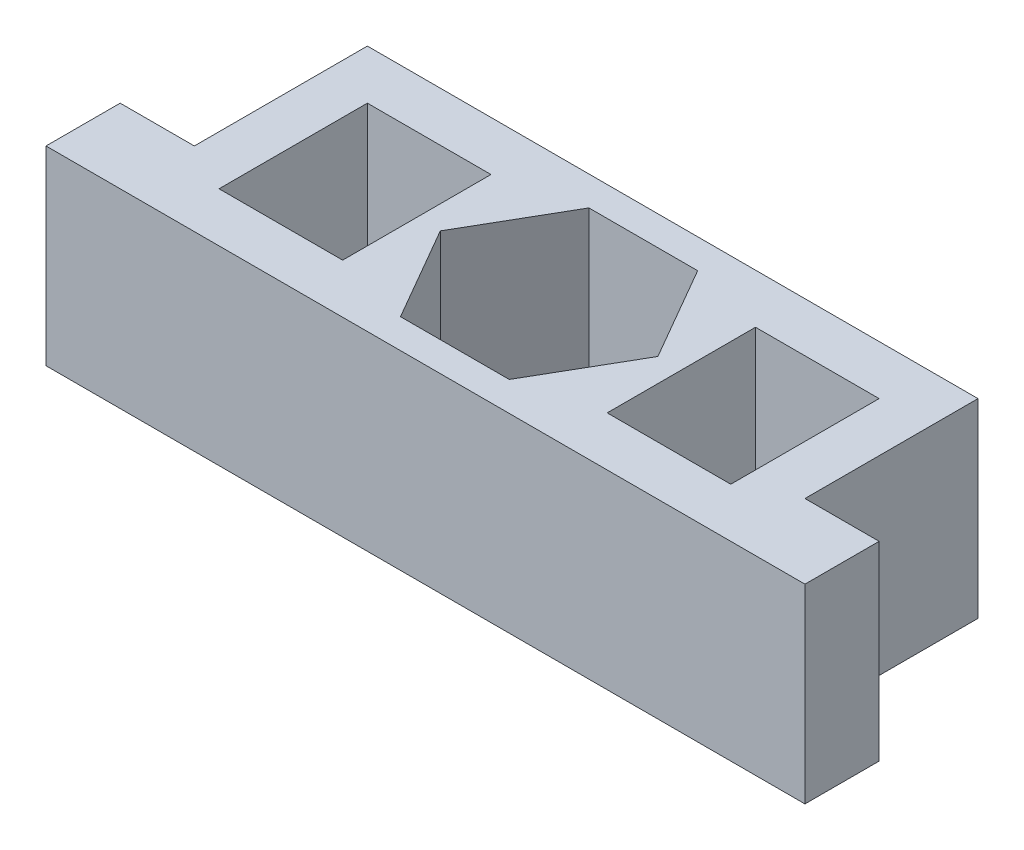
ISO-10303-21;
HEADER;
FILE_DESCRIPTION(('STEP AP214'),'2;1');
FILE_NAME('part.step','',(''),(''),'','','');
FILE_SCHEMA(('AUTOMOTIVE_DESIGN { 1 0 10303 214 1 1 1 1 }'));
ENDSEC;
DATA;
#1=APPLICATION_CONTEXT('core data for automotive mechanical design processes');
#2=APPLICATION_PROTOCOL_DEFINITION('international standard','automotive_design',2000,#1);
#3=PRODUCT_CONTEXT('',#1,'mechanical');
#4=PRODUCT('Part','Part','',(#3));
#5=PRODUCT_RELATED_PRODUCT_CATEGORY('part','',(#4));
#6=PRODUCT_DEFINITION_FORMATION('','',#4);
#7=PRODUCT_DEFINITION_CONTEXT('part definition',#1,'design');
#8=PRODUCT_DEFINITION('design','',#6,#7);
#9=PRODUCT_DEFINITION_SHAPE('','',#8);
#10=(LENGTH_UNIT() NAMED_UNIT(*) SI_UNIT(.MILLI.,.METRE.));
#11=(NAMED_UNIT(*) PLANE_ANGLE_UNIT() SI_UNIT($,.RADIAN.));
#12=(NAMED_UNIT(*) SI_UNIT($,.STERADIAN.) SOLID_ANGLE_UNIT());
#13=UNCERTAINTY_MEASURE_WITH_UNIT(LENGTH_MEASURE(1.E-05),#10,'distance_accuracy_value','');
#14=(GEOMETRIC_REPRESENTATION_CONTEXT(3) GLOBAL_UNCERTAINTY_ASSIGNED_CONTEXT((#13)) GLOBAL_UNIT_ASSIGNED_CONTEXT((#10,
#11,#12)) REPRESENTATION_CONTEXT('',''));
#15=CARTESIAN_POINT('',(0.,0.,0.));
#16=DIRECTION('',(0.,0.,1.));
#17=DIRECTION('',(1.,0.,0.));
#18=AXIS2_PLACEMENT_3D('',#15,#16,#17);
#19=CARTESIAN_POINT('',(12.35,3.85,10.));
#20=DIRECTION('',(-1.,0.,0.));
#21=DIRECTION('',(0.,-1.,0.));
#22=AXIS2_PLACEMENT_3D('',#19,#20,#21);
#23=PLANE('',#22);
#24=DIRECTION('',(0.,1.,0.));
#25=VECTOR('',#24,1.);
#26=CARTESIAN_POINT('',(12.35,3.85,7.));
#27=LINE('',#26,#25);
#28=CARTESIAN_POINT('',(12.35,-3.85,7.));
#29=VERTEX_POINT('',#28);
#30=CARTESIAN_POINT('',(12.35,3.85,7.));
#31=VERTEX_POINT('',#30);
#32=EDGE_CURVE('E60',#29,#31,#27,.T.);
#33=ORIENTED_EDGE('',*,*,#32,.F.);
#34=DIRECTION('',(0.,0.,-1.));
#35=VECTOR('',#34,1.);
#36=CARTESIAN_POINT('',(12.35,-3.85,10.));
#37=LINE('',#36,#35);
#38=CARTESIAN_POINT('',(12.35,-3.85,0.));
#39=VERTEX_POINT('',#38);
#40=EDGE_CURVE('E327',#29,#39,#37,.T.);
#41=ORIENTED_EDGE('',*,*,#40,.T.);
#42=DIRECTION('',(0.,1.,0.));
#43=VECTOR('',#42,1.);
#44=CARTESIAN_POINT('',(12.35,3.85,0.));
#45=LINE('',#44,#43);
#46=CARTESIAN_POINT('',(12.35,3.85,0.));
#47=VERTEX_POINT('',#46);
#48=EDGE_CURVE('E324',#39,#47,#45,.T.);
#49=ORIENTED_EDGE('',*,*,#48,.T.);
#50=DIRECTION('',(0.,0.,-1.));
#51=VECTOR('',#50,1.);
#52=CARTESIAN_POINT('',(12.35,3.85,10.));
#53=LINE('',#52,#51);
#54=EDGE_CURVE('E342',#31,#47,#53,.T.);
#55=ORIENTED_EDGE('',*,*,#54,.F.);
#56=EDGE_LOOP('',(#33,#41,#49,#55));
#57=FACE_BOUND('',#56,.T.);
#58=ADVANCED_FACE('F38',(#57),#23,.F.);
#59=CARTESIAN_POINT('',(-12.35,3.85,10.));
#60=DIRECTION('',(0.,-1.,0.));
#61=DIRECTION('',(0.,0.,-1.));
#62=AXIS2_PLACEMENT_3D('',#59,#60,#61);
#63=PLANE('',#62);
#64=DIRECTION('',(-1.,0.,0.));
#65=VECTOR('',#64,1.);
#66=CARTESIAN_POINT('',(-12.35,3.85,0.));
#67=LINE('',#66,#65);
#68=CARTESIAN_POINT('',(-12.35,3.85,0.));
#69=VERTEX_POINT('',#68);
#70=EDGE_CURVE('E330',#47,#69,#67,.T.);
#71=ORIENTED_EDGE('',*,*,#70,.T.);
#72=DIRECTION('',(0.,0.,-1.));
#73=VECTOR('',#72,1.);
#74=CARTESIAN_POINT('',(-12.35,3.85,10.));
#75=LINE('',#74,#73);
#76=CARTESIAN_POINT('',(-12.35,3.85,7.));
#77=VERTEX_POINT('',#76);
#78=EDGE_CURVE('E340',#77,#69,#75,.T.);
#79=ORIENTED_EDGE('',*,*,#78,.F.);
#80=DIRECTION('',(1.,0.,0.));
#81=VECTOR('',#80,1.);
#82=CARTESIAN_POINT('',(-15.35,3.85,7.));
#83=LINE('',#82,#81);
#84=CARTESIAN_POINT('',(-15.35,3.85,7.));
#85=VERTEX_POINT('',#84);
#86=EDGE_CURVE('E52',#85,#77,#83,.T.);
#87=ORIENTED_EDGE('',*,*,#86,.F.);
#88=DIRECTION('',(0.,0.,1.));
#89=VECTOR('',#88,1.);
#90=CARTESIAN_POINT('',(-15.35,3.85,10.));
#91=LINE('',#90,#89);
#92=CARTESIAN_POINT('',(-15.35,3.85,10.));
#93=VERTEX_POINT('',#92);
#94=EDGE_CURVE('E204',#85,#93,#91,.T.);
#95=ORIENTED_EDGE('',*,*,#94,.T.);
#96=DIRECTION('',(-1.,0.,0.));
#97=VECTOR('',#96,1.);
#98=CARTESIAN_POINT('',(-12.35,3.85,10.));
#99=LINE('',#98,#97);
#100=CARTESIAN_POINT('',(15.35,3.85,10.));
#101=VERTEX_POINT('',#100);
#102=EDGE_CURVE('E186',#101,#93,#99,.T.);
#103=ORIENTED_EDGE('',*,*,#102,.F.);
#104=DIRECTION('',(0.,0.,1.));
#105=VECTOR('',#104,1.);
#106=CARTESIAN_POINT('',(15.35,3.85,10.));
#107=LINE('',#106,#105);
#108=CARTESIAN_POINT('',(15.35,3.85,7.));
#109=VERTEX_POINT('',#108);
#110=EDGE_CURVE('E227',#109,#101,#107,.T.);
#111=ORIENTED_EDGE('',*,*,#110,.F.);
#112=DIRECTION('',(-1.,0.,0.));
#113=VECTOR('',#112,1.);
#114=CARTESIAN_POINT('',(15.35,3.85,7.));
#115=LINE('',#114,#113);
#116=EDGE_CURVE('E229',#109,#31,#115,.T.);
#117=ORIENTED_EDGE('',*,*,#116,.T.);
#118=ORIENTED_EDGE('',*,*,#54,.T.);
#119=EDGE_LOOP('',(#71,#79,#87,#95,#103,#111,#117,#118));
#120=FACE_BOUND('',#119,.T.);
#121=DIRECTION('',(1.,0.,0.));
#122=VECTOR('',#121,1.);
#123=CARTESIAN_POINT('',(-12.35,3.85,1.18948822334847));
#124=LINE('',#123,#122);
#125=CARTESIAN_POINT('',(-2.20000000000001,3.85,1.18948822334847));
#126=VERTEX_POINT('',#125);
#127=CARTESIAN_POINT('',(2.2,3.85,1.18948822334847));
#128=VERTEX_POINT('',#127);
#129=EDGE_CURVE('E319',#126,#128,#124,.T.);
#130=ORIENTED_EDGE('',*,*,#129,.T.);
#131=DIRECTION('',(0.5,0.,0.866025403784439));
#132=VECTOR('',#131,1.);
#133=CARTESIAN_POINT('',(2.3775635094611,3.85,1.49703724330533));
#134=LINE('',#133,#132);
#135=CARTESIAN_POINT('',(4.39999999999999,3.85,5.));
#136=VERTEX_POINT('',#135);
#137=EDGE_CURVE('E322',#128,#136,#134,.T.);
#138=ORIENTED_EDGE('',*,*,#137,.T.);
#139=DIRECTION('',(-0.5,0.,0.866025403784439));
#140=VECTOR('',#139,1.);
#141=CARTESIAN_POINT('',(-1.9525635094611,3.85,16.0029627566947));
#142=LINE('',#141,#140);
#143=CARTESIAN_POINT('',(2.19999999999999,3.85,8.81051177665153));
#144=VERTEX_POINT('',#143);
#145=EDGE_CURVE('E297',#136,#144,#142,.T.);
#146=ORIENTED_EDGE('',*,*,#145,.T.);
#147=DIRECTION('',(-1.,0.,0.));
#148=VECTOR('',#147,1.);
#149=CARTESIAN_POINT('',(-12.35,3.85,8.81051177665153));
#150=LINE('',#149,#148);
#151=CARTESIAN_POINT('',(-2.20000000000001,3.85,8.81051177665153));
#152=VERTEX_POINT('',#151);
#153=EDGE_CURVE('E310',#144,#152,#150,.T.);
#154=ORIENTED_EDGE('',*,*,#153,.T.);
#155=DIRECTION('',(-0.5,0.,-0.866025403784439));
#156=VECTOR('',#155,1.);
#157=CARTESIAN_POINT('',(-4.22243649053891,3.85,5.30754901995686));
#158=LINE('',#157,#156);
#159=CARTESIAN_POINT('',(-4.40000000000001,3.85,5.));
#160=VERTEX_POINT('',#159);
#161=EDGE_CURVE('E313',#152,#160,#158,.T.);
#162=ORIENTED_EDGE('',*,*,#161,.T.);
#163=DIRECTION('',(0.5,0.,-0.866025403784439));
#164=VECTOR('',#163,1.);
#165=CARTESIAN_POINT('',(-8.5525635094611,3.85,12.1924509800431));
#166=LINE('',#165,#164);
#167=EDGE_CURVE('E316',#160,#126,#166,.T.);
#168=ORIENTED_EDGE('',*,*,#167,.T.);
#169=EDGE_LOOP('',(#130,#138,#146,#154,#162,#168));
#170=FACE_BOUND('',#169,.T.);
#171=DIRECTION('',(1.,0.,0.));
#172=VECTOR('',#171,1.);
#173=CARTESIAN_POINT('',(-10.35,3.85,8.));
#174=LINE('',#173,#172);
#175=CARTESIAN_POINT('',(-10.35,3.85,8.));
#176=VERTEX_POINT('',#175);
#177=CARTESIAN_POINT('',(-5.35,3.85,8.));
#178=VERTEX_POINT('',#177);
#179=EDGE_CURVE('E259',#176,#178,#174,.T.);
#180=ORIENTED_EDGE('',*,*,#179,.F.);
#181=DIRECTION('',(0.,0.,1.));
#182=VECTOR('',#181,1.);
#183=CARTESIAN_POINT('',(-10.35,3.85,2.));
#184=LINE('',#183,#182);
#185=CARTESIAN_POINT('',(-10.35,3.85,2.));
#186=VERTEX_POINT('',#185);
#187=EDGE_CURVE('E251',#186,#176,#184,.T.);
#188=ORIENTED_EDGE('',*,*,#187,.F.);
#189=DIRECTION('',(-1.,0.,0.));
#190=VECTOR('',#189,1.);
#191=CARTESIAN_POINT('',(-10.35,3.85,2.));
#192=LINE('',#191,#190);
#193=CARTESIAN_POINT('',(-5.35,3.85,2.));
#194=VERTEX_POINT('',#193);
#195=EDGE_CURVE('E265',#194,#186,#192,.T.);
#196=ORIENTED_EDGE('',*,*,#195,.F.);
#197=DIRECTION('',(0.,0.,-1.));
#198=VECTOR('',#197,1.);
#199=CARTESIAN_POINT('',(-5.35,3.85,2.));
#200=LINE('',#199,#198);
#201=EDGE_CURVE('E262',#178,#194,#200,.T.);
#202=ORIENTED_EDGE('',*,*,#201,.F.);
#203=EDGE_LOOP('',(#180,#188,#196,#202));
#204=FACE_BOUND('',#203,.T.);
#205=DIRECTION('',(0.,0.,1.));
#206=VECTOR('',#205,1.);
#207=CARTESIAN_POINT('',(10.35,3.85,2.));
#208=LINE('',#207,#206);
#209=CARTESIAN_POINT('',(10.35,3.85,2.));
#210=VERTEX_POINT('',#209);
#211=CARTESIAN_POINT('',(10.35,3.85,8.));
#212=VERTEX_POINT('',#211);
#213=EDGE_CURVE('E236',#210,#212,#208,.T.);
#214=ORIENTED_EDGE('',*,*,#213,.T.);
#215=DIRECTION('',(-1.,0.,0.));
#216=VECTOR('',#215,1.);
#217=CARTESIAN_POINT('',(10.35,3.85,8.));
#218=LINE('',#217,#216);
#219=CARTESIAN_POINT('',(5.35,3.85,8.));
#220=VERTEX_POINT('',#219);
#221=EDGE_CURVE('E245',#212,#220,#218,.T.);
#222=ORIENTED_EDGE('',*,*,#221,.T.);
#223=DIRECTION('',(0.,0.,-1.));
#224=VECTOR('',#223,1.);
#225=CARTESIAN_POINT('',(5.35,3.85,2.));
#226=LINE('',#225,#224);
#227=CARTESIAN_POINT('',(5.35,3.85,2.));
#228=VERTEX_POINT('',#227);
#229=EDGE_CURVE('E242',#220,#228,#226,.T.);
#230=ORIENTED_EDGE('',*,*,#229,.T.);
#231=DIRECTION('',(1.,0.,0.));
#232=VECTOR('',#231,1.);
#233=CARTESIAN_POINT('',(10.35,3.85,2.));
#234=LINE('',#233,#232);
#235=EDGE_CURVE('E239',#228,#210,#234,.T.);
#236=ORIENTED_EDGE('',*,*,#235,.T.);
#237=EDGE_LOOP('',(#214,#222,#230,#236));
#238=FACE_BOUND('',#237,.T.);
#239=ADVANCED_FACE('F210',(#120,#170,#204,#238),#63,.F.);
#240=CARTESIAN_POINT('',(-12.35,-3.85,10.));
#241=DIRECTION('',(0.,1.,0.));
#242=DIRECTION('',(0.,0.,1.));
#243=AXIS2_PLACEMENT_3D('',#240,#241,#242);
#244=PLANE('',#243);
#245=DIRECTION('',(1.,0.,0.));
#246=VECTOR('',#245,1.);
#247=CARTESIAN_POINT('',(-12.35,-3.85,0.));
#248=LINE('',#247,#246);
#249=CARTESIAN_POINT('',(-12.35,-3.85,0.));
#250=VERTEX_POINT('',#249);
#251=EDGE_CURVE('E198',#250,#39,#248,.T.);
#252=ORIENTED_EDGE('',*,*,#251,.T.);
#253=ORIENTED_EDGE('',*,*,#40,.F.);
#254=DIRECTION('',(-1.,0.,0.));
#255=VECTOR('',#254,1.);
#256=CARTESIAN_POINT('',(15.35,-3.85,7.));
#257=LINE('',#256,#255);
#258=CARTESIAN_POINT('',(15.35,-3.85,7.));
#259=VERTEX_POINT('',#258);
#260=EDGE_CURVE('E233',#259,#29,#257,.T.);
#261=ORIENTED_EDGE('',*,*,#260,.F.);
#262=DIRECTION('',(0.,0.,-1.));
#263=VECTOR('',#262,1.);
#264=CARTESIAN_POINT('',(15.35,-3.85,10.));
#265=LINE('',#264,#263);
#266=CARTESIAN_POINT('',(15.35,-3.85,10.));
#267=VERTEX_POINT('',#266);
#268=EDGE_CURVE('E223',#267,#259,#265,.T.);
#269=ORIENTED_EDGE('',*,*,#268,.F.);
#270=DIRECTION('',(1.,0.,0.));
#271=VECTOR('',#270,1.);
#272=CARTESIAN_POINT('',(-12.35,-3.85,10.));
#273=LINE('',#272,#271);
#274=CARTESIAN_POINT('',(-15.35,-3.85,10.));
#275=VERTEX_POINT('',#274);
#276=EDGE_CURVE('E197',#275,#267,#273,.T.);
#277=ORIENTED_EDGE('',*,*,#276,.F.);
#278=DIRECTION('',(0.,0.,-1.));
#279=VECTOR('',#278,1.);
#280=CARTESIAN_POINT('',(-15.35,-3.85,10.));
#281=LINE('',#280,#279);
#282=CARTESIAN_POINT('',(-15.35,-3.85,7.));
#283=VERTEX_POINT('',#282);
#284=EDGE_CURVE('E206',#275,#283,#281,.T.);
#285=ORIENTED_EDGE('',*,*,#284,.T.);
#286=DIRECTION('',(1.,0.,0.));
#287=VECTOR('',#286,1.);
#288=CARTESIAN_POINT('',(-15.35,-3.85,7.));
#289=LINE('',#288,#287);
#290=CARTESIAN_POINT('',(-12.35,-3.85,7.));
#291=VERTEX_POINT('',#290);
#292=EDGE_CURVE('E218',#283,#291,#289,.T.);
#293=ORIENTED_EDGE('',*,*,#292,.T.);
#294=DIRECTION('',(0.,0.,-1.));
#295=VECTOR('',#294,1.);
#296=CARTESIAN_POINT('',(-12.35,-3.85,10.));
#297=LINE('',#296,#295);
#298=EDGE_CURVE('E338',#291,#250,#297,.T.);
#299=ORIENTED_EDGE('',*,*,#298,.T.);
#300=EDGE_LOOP('',(#252,#253,#261,#269,#277,#285,#293,#299));
#301=FACE_BOUND('',#300,.T.);
#302=DIRECTION('',(-0.5,0.,0.866025403784439));
#303=VECTOR('',#302,1.);
#304=CARTESIAN_POINT('',(4.39999999999999,-3.85,5.));
#305=LINE('',#304,#303);
#306=CARTESIAN_POINT('',(4.39999999999999,-3.85,5.));
#307=VERTEX_POINT('',#306);
#308=CARTESIAN_POINT('',(2.19999999999999,-3.85,8.81051177665153));
#309=VERTEX_POINT('',#308);
#310=EDGE_CURVE('E279',#307,#309,#305,.T.);
#311=ORIENTED_EDGE('',*,*,#310,.F.);
#312=DIRECTION('',(0.5,0.,0.866025403784439));
#313=VECTOR('',#312,1.);
#314=CARTESIAN_POINT('',(2.2,-3.85,1.18948822334847));
#315=LINE('',#314,#313);
#316=CARTESIAN_POINT('',(2.2,-3.85,1.18948822334847));
#317=VERTEX_POINT('',#316);
#318=EDGE_CURVE('E271',#317,#307,#315,.T.);
#319=ORIENTED_EDGE('',*,*,#318,.F.);
#320=DIRECTION('',(1.,0.,0.));
#321=VECTOR('',#320,1.);
#322=CARTESIAN_POINT('',(-2.20000000000001,-3.85,1.18948822334847));
#323=LINE('',#322,#321);
#324=CARTESIAN_POINT('',(-2.20000000000001,-3.85,1.18948822334847));
#325=VERTEX_POINT('',#324);
#326=EDGE_CURVE('E291',#325,#317,#323,.T.);
#327=ORIENTED_EDGE('',*,*,#326,.F.);
#328=DIRECTION('',(0.5,0.,-0.866025403784439));
#329=VECTOR('',#328,1.);
#330=CARTESIAN_POINT('',(-4.40000000000001,-3.85,5.));
#331=LINE('',#330,#329);
#332=CARTESIAN_POINT('',(-4.40000000000001,-3.85,5.));
#333=VERTEX_POINT('',#332);
#334=EDGE_CURVE('E288',#333,#325,#331,.T.);
#335=ORIENTED_EDGE('',*,*,#334,.F.);
#336=DIRECTION('',(-0.5,0.,-0.866025403784438));
#337=VECTOR('',#336,1.);
#338=CARTESIAN_POINT('',(-2.20000000000001,-3.85,8.81051177665153));
#339=LINE('',#338,#337);
#340=CARTESIAN_POINT('',(-2.20000000000001,-3.85,8.81051177665153));
#341=VERTEX_POINT('',#340);
#342=EDGE_CURVE('E285',#341,#333,#339,.T.);
#343=ORIENTED_EDGE('',*,*,#342,.F.);
#344=DIRECTION('',(-1.,0.,0.));
#345=VECTOR('',#344,1.);
#346=CARTESIAN_POINT('',(2.19999999999999,-3.85,8.81051177665153));
#347=LINE('',#346,#345);
#348=EDGE_CURVE('E282',#309,#341,#347,.T.);
#349=ORIENTED_EDGE('',*,*,#348,.F.);
#350=EDGE_LOOP('',(#311,#319,#327,#335,#343,#349));
#351=FACE_BOUND('',#350,.T.);
#352=DIRECTION('',(-1.,0.,0.));
#353=VECTOR('',#352,1.);
#354=CARTESIAN_POINT('',(-12.35,-3.85,2.));
#355=LINE('',#354,#353);
#356=CARTESIAN_POINT('',(-5.35,-3.85,2.));
#357=VERTEX_POINT('',#356);
#358=CARTESIAN_POINT('',(-10.35,-3.85,2.));
#359=VERTEX_POINT('',#358);
#360=EDGE_CURVE('E350',#357,#359,#355,.T.);
#361=ORIENTED_EDGE('',*,*,#360,.T.);
#362=DIRECTION('',(0.,0.,1.));
#363=VECTOR('',#362,1.);
#364=CARTESIAN_POINT('',(-10.35,-3.85,10.));
#365=LINE('',#364,#363);
#366=CARTESIAN_POINT('',(-10.35,-3.85,8.));
#367=VERTEX_POINT('',#366);
#368=EDGE_CURVE('E353',#359,#367,#365,.T.);
#369=ORIENTED_EDGE('',*,*,#368,.T.);
#370=DIRECTION('',(1.,0.,0.));
#371=VECTOR('',#370,1.);
#372=CARTESIAN_POINT('',(-12.35,-3.85,8.));
#373=LINE('',#372,#371);
#374=CARTESIAN_POINT('',(-5.35,-3.85,8.));
#375=VERTEX_POINT('',#374);
#376=EDGE_CURVE('E344',#367,#375,#373,.T.);
#377=ORIENTED_EDGE('',*,*,#376,.T.);
#378=DIRECTION('',(0.,0.,-1.));
#379=VECTOR('',#378,1.);
#380=CARTESIAN_POINT('',(-5.35,-3.85,10.));
#381=LINE('',#380,#379);
#382=EDGE_CURVE('E347',#375,#357,#381,.T.);
#383=ORIENTED_EDGE('',*,*,#382,.T.);
#384=EDGE_LOOP('',(#361,#369,#377,#383));
#385=FACE_BOUND('',#384,.T.);
#386=DIRECTION('',(0.,0.,1.));
#387=VECTOR('',#386,1.);
#388=CARTESIAN_POINT('',(10.35,-3.85,10.));
#389=LINE('',#388,#387);
#390=CARTESIAN_POINT('',(10.35,-3.85,2.));
#391=VERTEX_POINT('',#390);
#392=CARTESIAN_POINT('',(10.35,-3.85,8.));
#393=VERTEX_POINT('',#392);
#394=EDGE_CURVE('E11',#391,#393,#389,.T.);
#395=ORIENTED_EDGE('',*,*,#394,.F.);
#396=DIRECTION('',(1.,0.,0.));
#397=VECTOR('',#396,1.);
#398=CARTESIAN_POINT('',(-12.35,-3.85,2.));
#399=LINE('',#398,#397);
#400=CARTESIAN_POINT('',(5.35000000000001,-3.85,2.));
#401=VERTEX_POINT('',#400);
#402=EDGE_CURVE('E356',#401,#391,#399,.T.);
#403=ORIENTED_EDGE('',*,*,#402,.F.);
#404=DIRECTION('',(0.,0.,-1.));
#405=VECTOR('',#404,1.);
#406=CARTESIAN_POINT('',(5.35,-3.85,10.));
#407=LINE('',#406,#405);
#408=CARTESIAN_POINT('',(5.35,-3.85,8.));
#409=VERTEX_POINT('',#408);
#410=EDGE_CURVE('E358',#409,#401,#407,.T.);
#411=ORIENTED_EDGE('',*,*,#410,.F.);
#412=DIRECTION('',(-1.,0.,0.));
#413=VECTOR('',#412,1.);
#414=CARTESIAN_POINT('',(-12.35,-3.85,8.));
#415=LINE('',#414,#413);
#416=EDGE_CURVE('E45',#393,#409,#415,.T.);
#417=ORIENTED_EDGE('',*,*,#416,.F.);
#418=EDGE_LOOP('',(#395,#403,#411,#417));
#419=FACE_BOUND('',#418,.T.);
#420=ADVANCED_FACE('F373',(#301,#351,#385,#419),#244,.F.);
#421=CARTESIAN_POINT('',(-12.35,3.85,10.));
#422=DIRECTION('',(1.,0.,0.));
#423=DIRECTION('',(0.,1.,0.));
#424=AXIS2_PLACEMENT_3D('',#421,#422,#423);
#425=PLANE('',#424);
#426=ORIENTED_EDGE('',*,*,#298,.F.);
#427=DIRECTION('',(0.,1.,0.));
#428=VECTOR('',#427,1.);
#429=CARTESIAN_POINT('',(-12.35,3.85,7.));
#430=LINE('',#429,#428);
#431=EDGE_CURVE('E207',#291,#77,#430,.T.);
#432=ORIENTED_EDGE('',*,*,#431,.T.);
#433=ORIENTED_EDGE('',*,*,#78,.T.);
#434=DIRECTION('',(0.,-1.,0.));
#435=VECTOR('',#434,1.);
#436=CARTESIAN_POINT('',(-12.35,3.85,0.));
#437=LINE('',#436,#435);
#438=EDGE_CURVE('E332',#69,#250,#437,.T.);
#439=ORIENTED_EDGE('',*,*,#438,.T.);
#440=EDGE_LOOP('',(#426,#432,#433,#439));
#441=FACE_BOUND('',#440,.T.);
#442=ADVANCED_FACE('F386',(#441),#425,.F.);
#443=CARTESIAN_POINT('',(0.,0.,10.));
#444=DIRECTION('',(0.,0.,1.));
#445=DIRECTION('',(1.,0.,0.));
#446=AXIS2_PLACEMENT_3D('',#443,#444,#445);
#447=PLANE('',#446);
#448=ORIENTED_EDGE('',*,*,#276,.T.);
#449=DIRECTION('',(0.,-1.,0.));
#450=VECTOR('',#449,1.);
#451=CARTESIAN_POINT('',(15.35,3.85,10.));
#452=LINE('',#451,#450);
#453=EDGE_CURVE('E192',#101,#267,#452,.T.);
#454=ORIENTED_EDGE('',*,*,#453,.F.);
#455=ORIENTED_EDGE('',*,*,#102,.T.);
#456=DIRECTION('',(0.,-1.,0.));
#457=VECTOR('',#456,1.);
#458=CARTESIAN_POINT('',(-15.35,3.85,10.));
#459=LINE('',#458,#457);
#460=EDGE_CURVE('E189',#93,#275,#459,.T.);
#461=ORIENTED_EDGE('',*,*,#460,.T.);
#462=EDGE_LOOP('',(#448,#454,#455,#461));
#463=FACE_BOUND('',#462,.T.);
#464=ADVANCED_FACE('F188',(#463),#447,.T.);
#465=CARTESIAN_POINT('',(0.,0.,0.));
#466=DIRECTION('',(0.,0.,1.));
#467=DIRECTION('',(1.,0.,0.));
#468=AXIS2_PLACEMENT_3D('',#465,#466,#467);
#469=PLANE('',#468);
#470=ORIENTED_EDGE('',*,*,#48,.F.);
#471=ORIENTED_EDGE('',*,*,#251,.F.);
#472=ORIENTED_EDGE('',*,*,#438,.F.);
#473=ORIENTED_EDGE('',*,*,#70,.F.);
#474=EDGE_LOOP('',(#470,#471,#472,#473));
#475=FACE_BOUND('',#474,.T.);
#476=ADVANCED_FACE('F393',(#475),#469,.F.);
#477=CARTESIAN_POINT('',(2.2,6.15,1.18948822334847));
#478=DIRECTION('',(0.866025403784439,0.,-0.5));
#479=DIRECTION('',(-0.5,0.,-0.866025403784439));
#480=AXIS2_PLACEMENT_3D('',#477,#478,#479);
#481=PLANE('',#480);
#482=DIRECTION('',(0.,-1.,0.));
#483=VECTOR('',#482,1.);
#484=CARTESIAN_POINT('',(2.2,6.15,1.18948822334847));
#485=LINE('',#484,#483);
#486=EDGE_CURVE('E295',#128,#317,#485,.T.);
#487=ORIENTED_EDGE('',*,*,#486,.T.);
#488=ORIENTED_EDGE('',*,*,#318,.T.);
#489=DIRECTION('',(0.,-1.,0.));
#490=VECTOR('',#489,1.);
#491=CARTESIAN_POINT('',(4.39999999999999,6.15,5.));
#492=LINE('',#491,#490);
#493=EDGE_CURVE('E294',#136,#307,#492,.T.);
#494=ORIENTED_EDGE('',*,*,#493,.F.);
#495=ORIENTED_EDGE('',*,*,#137,.F.);
#496=EDGE_LOOP('',(#487,#488,#494,#495));
#497=FACE_BOUND('',#496,.T.);
#498=ADVANCED_FACE('F396',(#497),#481,.F.);
#499=CARTESIAN_POINT('',(-2.20000000000001,6.15,1.18948822334847));
#500=DIRECTION('',(0.,0.,-1.));
#501=DIRECTION('',(-1.,0.,0.));
#502=AXIS2_PLACEMENT_3D('',#499,#500,#501);
#503=PLANE('',#502);
#504=DIRECTION('',(0.,-1.,0.));
#505=VECTOR('',#504,1.);
#506=CARTESIAN_POINT('',(-2.20000000000001,6.15,1.18948822334847));
#507=LINE('',#506,#505);
#508=EDGE_CURVE('E298',#126,#325,#507,.T.);
#509=ORIENTED_EDGE('',*,*,#508,.T.);
#510=ORIENTED_EDGE('',*,*,#326,.T.);
#511=ORIENTED_EDGE('',*,*,#486,.F.);
#512=ORIENTED_EDGE('',*,*,#129,.F.);
#513=EDGE_LOOP('',(#509,#510,#511,#512));
#514=FACE_BOUND('',#513,.T.);
#515=ADVANCED_FACE('F402',(#514),#503,.F.);
#516=CARTESIAN_POINT('',(-4.40000000000001,6.15,5.));
#517=DIRECTION('',(-0.866025403784439,0.,-0.5));
#518=DIRECTION('',(-0.5,0.,0.866025403784439));
#519=AXIS2_PLACEMENT_3D('',#516,#517,#518);
#520=PLANE('',#519);
#521=DIRECTION('',(0.,-1.,0.));
#522=VECTOR('',#521,1.);
#523=CARTESIAN_POINT('',(-4.40000000000001,6.15,5.));
#524=LINE('',#523,#522);
#525=EDGE_CURVE('E300',#160,#333,#524,.T.);
#526=ORIENTED_EDGE('',*,*,#525,.T.);
#527=ORIENTED_EDGE('',*,*,#334,.T.);
#528=ORIENTED_EDGE('',*,*,#508,.F.);
#529=ORIENTED_EDGE('',*,*,#167,.F.);
#530=EDGE_LOOP('',(#526,#527,#528,#529));
#531=FACE_BOUND('',#530,.T.);
#532=ADVANCED_FACE('F416',(#531),#520,.F.);
#533=CARTESIAN_POINT('',(-2.20000000000001,6.15,8.81051177665153));
#534=DIRECTION('',(-0.866025403784439,0.,0.5));
#535=DIRECTION('',(0.5,0.,0.866025403784439));
#536=AXIS2_PLACEMENT_3D('',#533,#534,#535);
#537=PLANE('',#536);
#538=DIRECTION('',(0.,-1.,0.));
#539=VECTOR('',#538,1.);
#540=CARTESIAN_POINT('',(-2.20000000000001,6.15,8.81051177665153));
#541=LINE('',#540,#539);
#542=EDGE_CURVE('E302',#152,#341,#541,.T.);
#543=ORIENTED_EDGE('',*,*,#542,.T.);
#544=ORIENTED_EDGE('',*,*,#342,.T.);
#545=ORIENTED_EDGE('',*,*,#525,.F.);
#546=ORIENTED_EDGE('',*,*,#161,.F.);
#547=EDGE_LOOP('',(#543,#544,#545,#546));
#548=FACE_BOUND('',#547,.T.);
#549=ADVANCED_FACE('F412',(#548),#537,.F.);
#550=CARTESIAN_POINT('',(2.19999999999999,6.15,8.81051177665153));
#551=DIRECTION('',(0.,0.,1.));
#552=DIRECTION('',(1.,0.,0.));
#553=AXIS2_PLACEMENT_3D('',#550,#551,#552);
#554=PLANE('',#553);
#555=DIRECTION('',(0.,-1.,0.));
#556=VECTOR('',#555,1.);
#557=CARTESIAN_POINT('',(2.19999999999999,6.15,8.81051177665153));
#558=LINE('',#557,#556);
#559=EDGE_CURVE('E304',#144,#309,#558,.T.);
#560=ORIENTED_EDGE('',*,*,#559,.T.);
#561=ORIENTED_EDGE('',*,*,#348,.T.);
#562=ORIENTED_EDGE('',*,*,#542,.F.);
#563=ORIENTED_EDGE('',*,*,#153,.F.);
#564=EDGE_LOOP('',(#560,#561,#562,#563));
#565=FACE_BOUND('',#564,.T.);
#566=ADVANCED_FACE('F408',(#565),#554,.F.);
#567=CARTESIAN_POINT('',(4.39999999999999,6.15,5.));
#568=DIRECTION('',(0.866025403784439,0.,0.5));
#569=DIRECTION('',(0.5,0.,-0.866025403784439));
#570=AXIS2_PLACEMENT_3D('',#567,#568,#569);
#571=PLANE('',#570);
#572=ORIENTED_EDGE('',*,*,#493,.T.);
#573=ORIENTED_EDGE('',*,*,#310,.T.);
#574=ORIENTED_EDGE('',*,*,#559,.F.);
#575=ORIENTED_EDGE('',*,*,#145,.F.);
#576=EDGE_LOOP('',(#572,#573,#574,#575));
#577=FACE_BOUND('',#576,.T.);
#578=ADVANCED_FACE('F404',(#577),#571,.F.);
#579=CARTESIAN_POINT('',(-10.35,-6.15,2.));
#580=DIRECTION('',(-1.,0.,0.));
#581=DIRECTION('',(0.,0.,1.));
#582=AXIS2_PLACEMENT_3D('',#579,#580,#581);
#583=PLANE('',#582);
#584=DIRECTION('',(0.,1.,0.));
#585=VECTOR('',#584,1.);
#586=CARTESIAN_POINT('',(-10.35,-6.15,2.));
#587=LINE('',#586,#585);
#588=EDGE_CURVE('E269',#359,#186,#587,.T.);
#589=ORIENTED_EDGE('',*,*,#588,.T.);
#590=ORIENTED_EDGE('',*,*,#187,.T.);
#591=DIRECTION('',(0.,1.,0.));
#592=VECTOR('',#591,1.);
#593=CARTESIAN_POINT('',(-10.35,-6.15,8.));
#594=LINE('',#593,#592);
#595=EDGE_CURVE('E268',#367,#176,#594,.T.);
#596=ORIENTED_EDGE('',*,*,#595,.F.);
#597=ORIENTED_EDGE('',*,*,#368,.F.);
#598=EDGE_LOOP('',(#589,#590,#596,#597));
#599=FACE_BOUND('',#598,.T.);
#600=ADVANCED_FACE('F407',(#599),#583,.F.);
#601=CARTESIAN_POINT('',(-10.35,-6.15,2.));
#602=DIRECTION('',(0.,0.,-1.));
#603=DIRECTION('',(-1.,0.,0.));
#604=AXIS2_PLACEMENT_3D('',#601,#602,#603);
#605=PLANE('',#604);
#606=DIRECTION('',(0.,1.,0.));
#607=VECTOR('',#606,1.);
#608=CARTESIAN_POINT('',(-5.35,-6.15,2.));
#609=LINE('',#608,#607);
#610=EDGE_CURVE('E272',#357,#194,#609,.T.);
#611=ORIENTED_EDGE('',*,*,#610,.T.);
#612=ORIENTED_EDGE('',*,*,#195,.T.);
#613=ORIENTED_EDGE('',*,*,#588,.F.);
#614=ORIENTED_EDGE('',*,*,#360,.F.);
#615=EDGE_LOOP('',(#611,#612,#613,#614));
#616=FACE_BOUND('',#615,.T.);
#617=ADVANCED_FACE('F426',(#616),#605,.F.);
#618=CARTESIAN_POINT('',(-5.35,-6.15,2.));
#619=DIRECTION('',(1.,0.,0.));
#620=DIRECTION('',(0.,0.,-1.));
#621=AXIS2_PLACEMENT_3D('',#618,#619,#620);
#622=PLANE('',#621);
#623=DIRECTION('',(0.,1.,0.));
#624=VECTOR('',#623,1.);
#625=CARTESIAN_POINT('',(-5.35,-6.15,8.));
#626=LINE('',#625,#624);
#627=EDGE_CURVE('E274',#375,#178,#626,.T.);
#628=ORIENTED_EDGE('',*,*,#627,.T.);
#629=ORIENTED_EDGE('',*,*,#201,.T.);
#630=ORIENTED_EDGE('',*,*,#610,.F.);
#631=ORIENTED_EDGE('',*,*,#382,.F.);
#632=EDGE_LOOP('',(#628,#629,#630,#631));
#633=FACE_BOUND('',#632,.T.);
#634=ADVANCED_FACE('F431',(#633),#622,.F.);
#635=CARTESIAN_POINT('',(-10.35,-6.15,8.));
#636=DIRECTION('',(0.,0.,1.));
#637=DIRECTION('',(1.,0.,0.));
#638=AXIS2_PLACEMENT_3D('',#635,#636,#637);
#639=PLANE('',#638);
#640=ORIENTED_EDGE('',*,*,#595,.T.);
#641=ORIENTED_EDGE('',*,*,#179,.T.);
#642=ORIENTED_EDGE('',*,*,#627,.F.);
#643=ORIENTED_EDGE('',*,*,#376,.F.);
#644=EDGE_LOOP('',(#640,#641,#642,#643));
#645=FACE_BOUND('',#644,.T.);
#646=ADVANCED_FACE('F428',(#645),#639,.F.);
#647=CARTESIAN_POINT('',(10.35,-6.15,2.));
#648=DIRECTION('',(-1.,0.,0.));
#649=DIRECTION('',(0.,0.,1.));
#650=AXIS2_PLACEMENT_3D('',#647,#648,#649);
#651=PLANE('',#650);
#652=ORIENTED_EDGE('',*,*,#394,.T.);
#653=DIRECTION('',(0.,1.,0.));
#654=VECTOR('',#653,1.);
#655=CARTESIAN_POINT('',(10.35,-6.15,8.));
#656=LINE('',#655,#654);
#657=EDGE_CURVE('E249',#393,#212,#656,.T.);
#658=ORIENTED_EDGE('',*,*,#657,.T.);
#659=ORIENTED_EDGE('',*,*,#213,.F.);
#660=DIRECTION('',(0.,1.,0.));
#661=VECTOR('',#660,1.);
#662=CARTESIAN_POINT('',(10.35,-6.15,2.));
#663=LINE('',#662,#661);
#664=EDGE_CURVE('E248',#391,#210,#663,.T.);
#665=ORIENTED_EDGE('',*,*,#664,.F.);
#666=EDGE_LOOP('',(#652,#658,#659,#665));
#667=FACE_BOUND('',#666,.T.);
#668=ADVANCED_FACE('F379',(#667),#651,.T.);
#669=CARTESIAN_POINT('',(10.35,-6.15,8.));
#670=DIRECTION('',(0.,0.,-1.));
#671=DIRECTION('',(-1.,0.,0.));
#672=AXIS2_PLACEMENT_3D('',#669,#670,#671);
#673=PLANE('',#672);
#674=ORIENTED_EDGE('',*,*,#416,.T.);
#675=DIRECTION('',(0.,1.,0.));
#676=VECTOR('',#675,1.);
#677=CARTESIAN_POINT('',(5.35,-6.15,8.));
#678=LINE('',#677,#676);
#679=EDGE_CURVE('E252',#409,#220,#678,.T.);
#680=ORIENTED_EDGE('',*,*,#679,.T.);
#681=ORIENTED_EDGE('',*,*,#221,.F.);
#682=ORIENTED_EDGE('',*,*,#657,.F.);
#683=EDGE_LOOP('',(#674,#680,#681,#682));
#684=FACE_BOUND('',#683,.T.);
#685=ADVANCED_FACE('F364',(#684),#673,.T.);
#686=CARTESIAN_POINT('',(5.35,-6.15,2.));
#687=DIRECTION('',(1.,0.,0.));
#688=DIRECTION('',(0.,0.,-1.));
#689=AXIS2_PLACEMENT_3D('',#686,#687,#688);
#690=PLANE('',#689);
#691=ORIENTED_EDGE('',*,*,#410,.T.);
#692=DIRECTION('',(0.,1.,0.));
#693=VECTOR('',#692,1.);
#694=CARTESIAN_POINT('',(5.35,-6.15,2.));
#695=LINE('',#694,#693);
#696=EDGE_CURVE('E254',#401,#228,#695,.T.);
#697=ORIENTED_EDGE('',*,*,#696,.T.);
#698=ORIENTED_EDGE('',*,*,#229,.F.);
#699=ORIENTED_EDGE('',*,*,#679,.F.);
#700=EDGE_LOOP('',(#691,#697,#698,#699));
#701=FACE_BOUND('',#700,.T.);
#702=ADVANCED_FACE('F371',(#701),#690,.T.);
#703=CARTESIAN_POINT('',(10.35,-6.15,2.));
#704=DIRECTION('',(0.,0.,1.));
#705=DIRECTION('',(1.,0.,0.));
#706=AXIS2_PLACEMENT_3D('',#703,#704,#705);
#707=PLANE('',#706);
#708=ORIENTED_EDGE('',*,*,#402,.T.);
#709=ORIENTED_EDGE('',*,*,#664,.T.);
#710=ORIENTED_EDGE('',*,*,#235,.F.);
#711=ORIENTED_EDGE('',*,*,#696,.F.);
#712=EDGE_LOOP('',(#708,#709,#710,#711));
#713=FACE_BOUND('',#712,.T.);
#714=ADVANCED_FACE('F376',(#713),#707,.T.);
#715=CARTESIAN_POINT('',(15.35,3.85,7.));
#716=DIRECTION('',(0.,0.,1.));
#717=DIRECTION('',(0.,-1.,0.));
#718=AXIS2_PLACEMENT_3D('',#715,#716,#717);
#719=PLANE('',#718);
#720=ORIENTED_EDGE('',*,*,#32,.T.);
#721=ORIENTED_EDGE('',*,*,#116,.F.);
#722=DIRECTION('',(0.,1.,0.));
#723=VECTOR('',#722,1.);
#724=CARTESIAN_POINT('',(15.35,3.85,7.));
#725=LINE('',#724,#723);
#726=EDGE_CURVE('E225',#259,#109,#725,.T.);
#727=ORIENTED_EDGE('',*,*,#726,.F.);
#728=ORIENTED_EDGE('',*,*,#260,.T.);
#729=EDGE_LOOP('',(#720,#721,#727,#728));
#730=FACE_BOUND('',#729,.T.);
#731=ADVANCED_FACE('F443',(#730),#719,.F.);
#732=CARTESIAN_POINT('',(15.35,0.,0.));
#733=DIRECTION('',(1.,0.,0.));
#734=DIRECTION('',(0.,1.,0.));
#735=AXIS2_PLACEMENT_3D('',#732,#733,#734);
#736=PLANE('',#735);
#737=ORIENTED_EDGE('',*,*,#453,.T.);
#738=ORIENTED_EDGE('',*,*,#268,.T.);
#739=ORIENTED_EDGE('',*,*,#726,.T.);
#740=ORIENTED_EDGE('',*,*,#110,.T.);
#741=EDGE_LOOP('',(#737,#738,#739,#740));
#742=FACE_BOUND('',#741,.T.);
#743=ADVANCED_FACE('F450',(#742),#736,.T.);
#744=CARTESIAN_POINT('',(-15.35,3.85,7.));
#745=DIRECTION('',(0.,0.,-1.));
#746=DIRECTION('',(0.,1.,0.));
#747=AXIS2_PLACEMENT_3D('',#744,#745,#746);
#748=PLANE('',#747);
#749=ORIENTED_EDGE('',*,*,#431,.F.);
#750=ORIENTED_EDGE('',*,*,#292,.F.);
#751=DIRECTION('',(0.,1.,0.));
#752=VECTOR('',#751,1.);
#753=CARTESIAN_POINT('',(-15.35,3.85,7.));
#754=LINE('',#753,#752);
#755=EDGE_CURVE('E213',#283,#85,#754,.T.);
#756=ORIENTED_EDGE('',*,*,#755,.T.);
#757=ORIENTED_EDGE('',*,*,#86,.T.);
#758=EDGE_LOOP('',(#749,#750,#756,#757));
#759=FACE_BOUND('',#758,.T.);
#760=ADVANCED_FACE('F454',(#759),#748,.T.);
#761=CARTESIAN_POINT('',(-15.35,0.,0.));
#762=DIRECTION('',(-1.,0.,0.));
#763=DIRECTION('',(0.,1.,0.));
#764=AXIS2_PLACEMENT_3D('',#761,#762,#763);
#765=PLANE('',#764);
#766=ORIENTED_EDGE('',*,*,#460,.F.);
#767=ORIENTED_EDGE('',*,*,#94,.F.);
#768=ORIENTED_EDGE('',*,*,#755,.F.);
#769=ORIENTED_EDGE('',*,*,#284,.F.);
#770=EDGE_LOOP('',(#766,#767,#768,#769));
#771=FACE_BOUND('',#770,.T.);
#772=ADVANCED_FACE('F202',(#771),#765,.T.);
#773=CLOSED_SHELL('',(#58,#239,#420,#442,#464,#476,#498,#515,#532,#549,#566,#578,#600,#617,#634,
#646,#668,#685,#702,#714,#731,#743,#760,#772));
#774=MANIFOLD_SOLID_BREP('B2',#773);
#775=ADVANCED_BREP_SHAPE_REPRESENTATION('',(#18,#774),#14);
#776=SHAPE_DEFINITION_REPRESENTATION(#9,#775);
ENDSEC;
END-ISO-10303-21;
